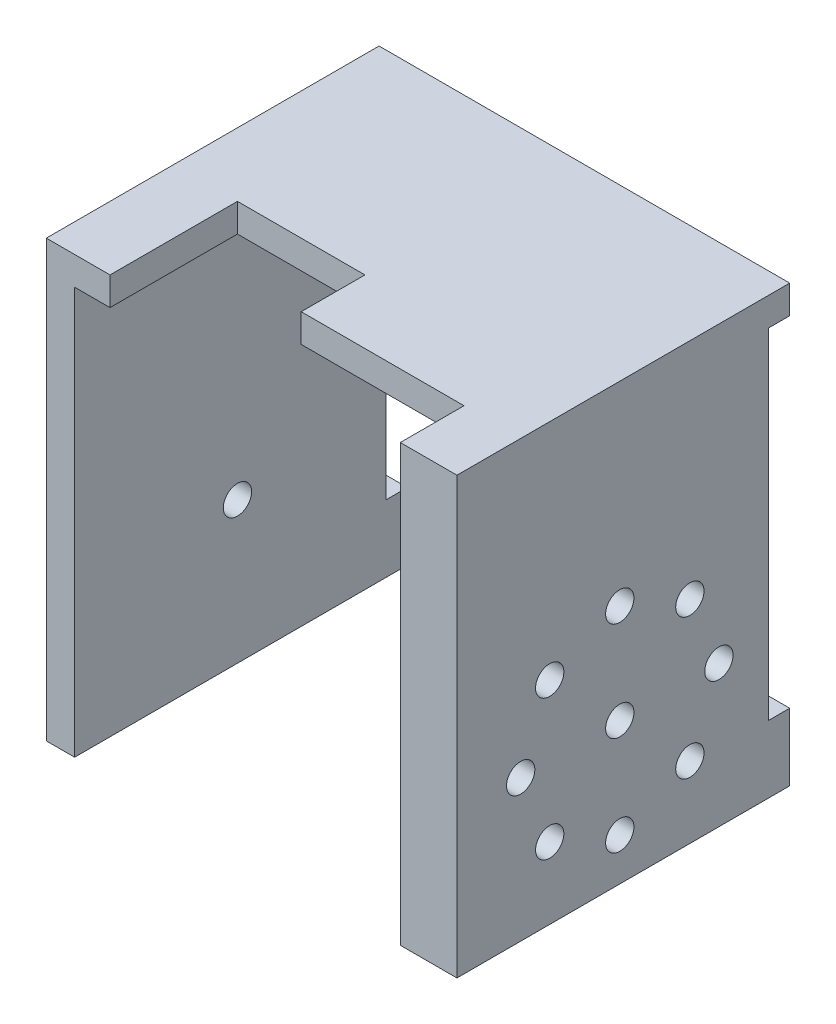
ISO-10303-21;
HEADER;
FILE_DESCRIPTION(('STEP AP214'),'2;1');
FILE_NAME('part.step','',(''),(''),'','','');
FILE_SCHEMA(('AUTOMOTIVE_DESIGN { 1 0 10303 214 1 1 1 1 }'));
ENDSEC;
DATA;
#1=APPLICATION_CONTEXT('core data for automotive mechanical design processes');
#2=APPLICATION_PROTOCOL_DEFINITION('international standard','automotive_design',2000,#1);
#3=PRODUCT_CONTEXT('',#1,'mechanical');
#4=PRODUCT('Part','Part','',(#3));
#5=PRODUCT_RELATED_PRODUCT_CATEGORY('part','',(#4));
#6=PRODUCT_DEFINITION_FORMATION('','',#4);
#7=PRODUCT_DEFINITION_CONTEXT('part definition',#1,'design');
#8=PRODUCT_DEFINITION('design','',#6,#7);
#9=PRODUCT_DEFINITION_SHAPE('','',#8);
#10=(LENGTH_UNIT() NAMED_UNIT(*) SI_UNIT(.MILLI.,.METRE.));
#11=(NAMED_UNIT(*) PLANE_ANGLE_UNIT() SI_UNIT($,.RADIAN.));
#12=(NAMED_UNIT(*) SI_UNIT($,.STERADIAN.) SOLID_ANGLE_UNIT());
#13=UNCERTAINTY_MEASURE_WITH_UNIT(LENGTH_MEASURE(1.E-05),#10,'distance_accuracy_value','');
#14=(GEOMETRIC_REPRESENTATION_CONTEXT(3) GLOBAL_UNCERTAINTY_ASSIGNED_CONTEXT((#13)) GLOBAL_UNIT_ASSIGNED_CONTEXT((#10,
#11,#12)) REPRESENTATION_CONTEXT('',''));
#15=CARTESIAN_POINT('',(0.,0.,0.));
#16=DIRECTION('',(0.,0.,1.));
#17=DIRECTION('',(1.,0.,0.));
#18=AXIS2_PLACEMENT_3D('',#15,#16,#17);
#19=CARTESIAN_POINT('',(46.,37.5,47.));
#20=DIRECTION('',(0.,0.,-1.));
#21=DIRECTION('',(-1.,0.,0.));
#22=AXIS2_PLACEMENT_3D('',#19,#20,#21);
#23=PLANE('',#22);
#24=DIRECTION('',(-1.,0.,0.));
#25=VECTOR('',#24,1.);
#26=CARTESIAN_POINT('',(-4.,41.5,47.));
#27=LINE('',#26,#25);
#28=CARTESIAN_POINT('',(54.,41.5,47.));
#29=VERTEX_POINT('',#28);
#30=CARTESIAN_POINT('',(46.0000000000002,41.5,47.));
#31=VERTEX_POINT('',#30);
#32=EDGE_CURVE('E312',#29,#31,#27,.T.);
#33=ORIENTED_EDGE('',*,*,#32,.T.);
#34=DIRECTION('',(0.,-1.,0.));
#35=VECTOR('',#34,1.);
#36=CARTESIAN_POINT('',(46.,37.5,47.));
#37=LINE('',#36,#35);
#38=CARTESIAN_POINT('',(46.0000000000002,-20.,47.));
#39=VERTEX_POINT('',#38);
#40=EDGE_CURVE('E305',#31,#39,#37,.T.);
#41=ORIENTED_EDGE('',*,*,#40,.T.);
#42=DIRECTION('',(1.,0.,0.));
#43=VECTOR('',#42,1.);
#44=CARTESIAN_POINT('',(46.0000000000002,-20.,47.));
#45=LINE('',#44,#43);
#46=CARTESIAN_POINT('',(54.0000000000002,-20.,47.));
#47=VERTEX_POINT('',#46);
#48=EDGE_CURVE('E308',#39,#47,#45,.T.);
#49=ORIENTED_EDGE('',*,*,#48,.T.);
#50=DIRECTION('',(0.,1.,0.));
#51=VECTOR('',#50,1.);
#52=CARTESIAN_POINT('',(54.,41.5,47.));
#53=LINE('',#52,#51);
#54=EDGE_CURVE('E310',#47,#29,#53,.T.);
#55=ORIENTED_EDGE('',*,*,#54,.T.);
#56=EDGE_LOOP('',(#33,#41,#49,#55));
#57=FACE_BOUND('',#56,.T.);
#58=ADVANCED_FACE('F31',(#57),#23,.F.);
#59=CARTESIAN_POINT('',(46.,37.5,0.));
#60=DIRECTION('',(0.,0.,-1.));
#61=DIRECTION('',(-1.,0.,0.));
#62=AXIS2_PLACEMENT_3D('',#59,#60,#61);
#63=PLANE('',#62);
#64=DIRECTION('',(1.,0.,0.));
#65=VECTOR('',#64,1.);
#66=CARTESIAN_POINT('',(-4.00000000000005,-10.5000000000002,0.));
#67=LINE('',#66,#65);
#68=CARTESIAN_POINT('',(-4.00000000000005,-10.5000000000002,0.));
#69=VERTEX_POINT('',#68);
#70=CARTESIAN_POINT('',(0.,-10.5000000000002,0.));
#71=VERTEX_POINT('',#70);
#72=EDGE_CURVE('E284',#69,#71,#67,.T.);
#73=ORIENTED_EDGE('',*,*,#72,.T.);
#74=DIRECTION('',(0.,1.,0.));
#75=VECTOR('',#74,1.);
#76=CARTESIAN_POINT('',(0.,-20.,0.));
#77=LINE('',#76,#75);
#78=CARTESIAN_POINT('',(0.,-20.,0.));
#79=VERTEX_POINT('',#78);
#80=EDGE_CURVE('E306',#79,#71,#77,.T.);
#81=ORIENTED_EDGE('',*,*,#80,.F.);
#82=DIRECTION('',(1.,0.,0.));
#83=VECTOR('',#82,1.);
#84=CARTESIAN_POINT('',(0.,-20.,0.));
#85=LINE('',#84,#83);
#86=CARTESIAN_POINT('',(-4.00000000000001,-20.,0.));
#87=VERTEX_POINT('',#86);
#88=EDGE_CURVE('E337',#87,#79,#85,.T.);
#89=ORIENTED_EDGE('',*,*,#88,.F.);
#90=DIRECTION('',(0.,-1.,0.));
#91=VECTOR('',#90,1.);
#92=CARTESIAN_POINT('',(-4.00000000000001,-20.,0.));
#93=LINE('',#92,#91);
#94=EDGE_CURVE('E333',#69,#87,#93,.T.);
#95=ORIENTED_EDGE('',*,*,#94,.F.);
#96=EDGE_LOOP('',(#73,#81,#89,#95));
#97=FACE_BOUND('',#96,.T.);
#98=ADVANCED_FACE('F423',(#97),#63,.T.);
#99=DIRECTION('',(-1.,0.,0.));
#100=VECTOR('',#99,1.);
#101=CARTESIAN_POINT('',(46.0000000000002,-10.5,0.));
#102=LINE('',#101,#100);
#103=CARTESIAN_POINT('',(54.0000000000002,-10.5,0.));
#104=VERTEX_POINT('',#103);
#105=CARTESIAN_POINT('',(46.0000000000001,-10.5,0.));
#106=VERTEX_POINT('',#105);
#107=EDGE_CURVE('E40',#104,#106,#102,.T.);
#108=ORIENTED_EDGE('',*,*,#107,.F.);
#109=DIRECTION('',(0.,1.,0.));
#110=VECTOR('',#109,1.);
#111=CARTESIAN_POINT('',(54.,41.5,0.));
#112=LINE('',#111,#110);
#113=CARTESIAN_POINT('',(54.0000000000002,-20.,0.));
#114=VERTEX_POINT('',#113);
#115=EDGE_CURVE('E328',#114,#104,#112,.T.);
#116=ORIENTED_EDGE('',*,*,#115,.F.);
#117=DIRECTION('',(1.,0.,0.));
#118=VECTOR('',#117,1.);
#119=CARTESIAN_POINT('',(46.0000000000002,-20.,0.));
#120=LINE('',#119,#118);
#121=CARTESIAN_POINT('',(46.0000000000002,-20.,0.));
#122=VERTEX_POINT('',#121);
#123=EDGE_CURVE('E325',#122,#114,#120,.T.);
#124=ORIENTED_EDGE('',*,*,#123,.F.);
#125=DIRECTION('',(0.,-1.,0.));
#126=VECTOR('',#125,1.);
#127=CARTESIAN_POINT('',(46.,37.5,0.));
#128=LINE('',#127,#126);
#129=EDGE_CURVE('E323',#106,#122,#128,.T.);
#130=ORIENTED_EDGE('',*,*,#129,.F.);
#131=EDGE_LOOP('',(#108,#116,#124,#130));
#132=FACE_BOUND('',#131,.T.);
#133=ADVANCED_FACE('F376',(#132),#63,.T.);
#134=CARTESIAN_POINT('',(0.,37.5,47.));
#135=DIRECTION('',(0.,1.,0.));
#136=DIRECTION('',(-1.,0.,0.));
#137=AXIS2_PLACEMENT_3D('',#134,#135,#136);
#138=PLANE('',#137);
#139=DIRECTION('',(0.,0.,-1.));
#140=VECTOR('',#139,1.);
#141=CARTESIAN_POINT('',(46.,37.5,47.));
#142=LINE('',#141,#140);
#143=CARTESIAN_POINT('',(46.,37.5,38.));
#144=VERTEX_POINT('',#143);
#145=CARTESIAN_POINT('',(46.,37.5,3.00000000000001));
#146=VERTEX_POINT('',#145);
#147=EDGE_CURVE('E361',#144,#146,#142,.T.);
#148=ORIENTED_EDGE('',*,*,#147,.F.);
#149=DIRECTION('',(1.,0.,0.));
#150=VECTOR('',#149,1.);
#151=CARTESIAN_POINT('',(23.,37.5,38.));
#152=LINE('',#151,#150);
#153=CARTESIAN_POINT('',(23.,37.5,38.));
#154=VERTEX_POINT('',#153);
#155=EDGE_CURVE('E186',#154,#144,#152,.T.);
#156=ORIENTED_EDGE('',*,*,#155,.F.);
#157=DIRECTION('',(0.,0.,1.));
#158=VECTOR('',#157,1.);
#159=CARTESIAN_POINT('',(23.,37.5,38.));
#160=LINE('',#159,#158);
#161=CARTESIAN_POINT('',(23.,37.5,29.));
#162=VERTEX_POINT('',#161);
#163=EDGE_CURVE('E189',#162,#154,#160,.T.);
#164=ORIENTED_EDGE('',*,*,#163,.F.);
#165=DIRECTION('',(1.,0.,0.));
#166=VECTOR('',#165,1.);
#167=CARTESIAN_POINT('',(5.00000000000004,37.5,29.));
#168=LINE('',#167,#166);
#169=CARTESIAN_POINT('',(5.00000000000004,37.5,29.));
#170=VERTEX_POINT('',#169);
#171=EDGE_CURVE('E199',#170,#162,#168,.T.);
#172=ORIENTED_EDGE('',*,*,#171,.F.);
#173=DIRECTION('',(0.,0.,-1.));
#174=VECTOR('',#173,1.);
#175=CARTESIAN_POINT('',(5.00000000000003,37.5,47.));
#176=LINE('',#175,#174);
#177=CARTESIAN_POINT('',(5.00000000000003,37.5,47.));
#178=VERTEX_POINT('',#177);
#179=EDGE_CURVE('E166',#178,#170,#176,.T.);
#180=ORIENTED_EDGE('',*,*,#179,.F.);
#181=DIRECTION('',(1.,0.,0.));
#182=VECTOR('',#181,1.);
#183=CARTESIAN_POINT('',(0.,37.5,47.));
#184=LINE('',#183,#182);
#185=CARTESIAN_POINT('',(0.,37.5,47.));
#186=VERTEX_POINT('',#185);
#187=EDGE_CURVE('E302',#186,#178,#184,.T.);
#188=ORIENTED_EDGE('',*,*,#187,.F.);
#189=DIRECTION('',(0.,0.,-1.));
#190=VECTOR('',#189,1.);
#191=CARTESIAN_POINT('',(0.,37.5,47.));
#192=LINE('',#191,#190);
#193=CARTESIAN_POINT('',(0.,37.4999999999998,3.00000000000001));
#194=VERTEX_POINT('',#193);
#195=EDGE_CURVE('E321',#186,#194,#192,.T.);
#196=ORIENTED_EDGE('',*,*,#195,.T.);
#197=DIRECTION('',(1.,0.,0.));
#198=VECTOR('',#197,1.);
#199=CARTESIAN_POINT('',(-4.00000000000021,37.4999999999998,3.00000000000001));
#200=LINE('',#199,#198);
#201=CARTESIAN_POINT('',(-4.00000000000021,37.4999999999998,3.00000000000001));
#202=VERTEX_POINT('',#201);
#203=EDGE_CURVE('E292',#202,#194,#200,.T.);
#204=ORIENTED_EDGE('',*,*,#203,.F.);
#205=DIRECTION('',(0.,0.,1.));
#206=VECTOR('',#205,1.);
#207=CARTESIAN_POINT('',(-4.00000000000021,37.4999999999998,0.));
#208=LINE('',#207,#206);
#209=CARTESIAN_POINT('',(-4.,37.4999999999998,0.));
#210=VERTEX_POINT('',#209);
#211=EDGE_CURVE('E267',#210,#202,#208,.T.);
#212=ORIENTED_EDGE('',*,*,#211,.F.);
#213=DIRECTION('',(1.,0.,0.));
#214=VECTOR('',#213,1.);
#215=CARTESIAN_POINT('',(0.,37.5,0.));
#216=LINE('',#215,#214);
#217=CARTESIAN_POINT('',(54.,37.5,0.));
#218=VERTEX_POINT('',#217);
#219=EDGE_CURVE('E55',#210,#218,#216,.T.);
#220=ORIENTED_EDGE('',*,*,#219,.T.);
#221=DIRECTION('',(0.,0.,1.));
#222=VECTOR('',#221,1.);
#223=CARTESIAN_POINT('',(54.,37.5,0.));
#224=LINE('',#223,#222);
#225=CARTESIAN_POINT('',(54.,37.5,3.00000000000001));
#226=VERTEX_POINT('',#225);
#227=EDGE_CURVE('E266',#218,#226,#224,.T.);
#228=ORIENTED_EDGE('',*,*,#227,.T.);
#229=EDGE_CURVE('E277',#146,#226,#200,.T.);
#230=ORIENTED_EDGE('',*,*,#229,.F.);
#231=EDGE_LOOP('',(#148,#156,#164,#172,#180,#188,#196,#204,#212,#220,#228,#230));
#232=FACE_BOUND('',#231,.T.);
#233=ADVANCED_FACE('F33',(#232),#138,.F.);
#234=CARTESIAN_POINT('',(46.,37.5,47.));
#235=DIRECTION('',(1.,0.,0.));
#236=DIRECTION('',(0.,1.,0.));
#237=AXIS2_PLACEMENT_3D('',#234,#235,#236);
#238=PLANE('',#237);
#239=CARTESIAN_POINT('',(46.0000000000001,9.89949493661152,33.899494936612));
#240=DIRECTION('',(1.,0.,0.));
#241=DIRECTION('',(0.,1.,0.));
#242=AXIS2_PLACEMENT_3D('',#239,#240,#241);
#243=CIRCLE('',#242,2.00000000000028);
#244=CARTESIAN_POINT('',(46.0000000000001,11.8994949366118,33.899494936612));
#245=VERTEX_POINT('',#244);
#246=EDGE_CURVE('E210',#245,#245,#243,.F.);
#247=ORIENTED_EDGE('',*,*,#246,.F.);
#248=EDGE_LOOP('',(#247));
#249=FACE_BOUND('',#248,.T.);
#250=CARTESIAN_POINT('',(46.0000000000001,-1.07975958797385E-13,37.9999999999998));
#251=DIRECTION('',(1.,0.,0.));
#252=DIRECTION('',(0.,1.,0.));
#253=AXIS2_PLACEMENT_3D('',#250,#251,#252);
#254=CIRCLE('',#253,2.);
#255=CARTESIAN_POINT('',(46.0000000000001,1.99999999999989,37.9999999999998));
#256=VERTEX_POINT('',#255);
#257=EDGE_CURVE('E216',#256,#256,#254,.F.);
#258=ORIENTED_EDGE('',*,*,#257,.F.);
#259=EDGE_LOOP('',(#258));
#260=FACE_BOUND('',#259,.T.);
#261=CARTESIAN_POINT('',(46.0000000000002,-9.89949493661177,33.8994949366114));
#262=DIRECTION('',(1.,0.,0.));
#263=DIRECTION('',(0.,1.,0.));
#264=AXIS2_PLACEMENT_3D('',#261,#262,#263);
#265=CIRCLE('',#264,2.);
#266=CARTESIAN_POINT('',(46.0000000000002,-7.89949493661177,33.8994949366114));
#267=VERTEX_POINT('',#266);
#268=EDGE_CURVE('E222',#267,#267,#265,.F.);
#269=ORIENTED_EDGE('',*,*,#268,.F.);
#270=EDGE_LOOP('',(#269));
#271=FACE_BOUND('',#270,.T.);
#272=CARTESIAN_POINT('',(46.0000000000002,-14.0000000000001,23.9999999999997));
#273=DIRECTION('',(1.,0.,0.));
#274=DIRECTION('',(0.,1.,0.));
#275=AXIS2_PLACEMENT_3D('',#272,#273,#274);
#276=CIRCLE('',#275,2.);
#277=CARTESIAN_POINT('',(46.0000000000002,-12.0000000000001,23.9999999999997));
#278=VERTEX_POINT('',#277);
#279=EDGE_CURVE('E228',#278,#278,#276,.F.);
#280=ORIENTED_EDGE('',*,*,#279,.F.);
#281=EDGE_LOOP('',(#280));
#282=FACE_BOUND('',#281,.T.);
#283=CARTESIAN_POINT('',(46.0000000000002,-9.89949493661163,14.1005050633881));
#284=DIRECTION('',(1.,0.,0.));
#285=DIRECTION('',(0.,1.,0.));
#286=AXIS2_PLACEMENT_3D('',#283,#284,#285);
#287=CIRCLE('',#286,2.);
#288=CARTESIAN_POINT('',(46.0000000000002,-7.89949493661163,14.1005050633881));
#289=VERTEX_POINT('',#288);
#290=EDGE_CURVE('E234',#289,#289,#287,.F.);
#291=ORIENTED_EDGE('',*,*,#290,.F.);
#292=EDGE_LOOP('',(#291));
#293=FACE_BOUND('',#292,.T.);
#294=CARTESIAN_POINT('',(46.0000000000001,0.,9.9999999999998));
#295=DIRECTION('',(1.,0.,0.));
#296=DIRECTION('',(0.,1.,0.));
#297=AXIS2_PLACEMENT_3D('',#294,#295,#296);
#298=CIRCLE('',#297,2.);
#299=CARTESIAN_POINT('',(46.0000000000001,2.0000000000001,9.9999999999998));
#300=VERTEX_POINT('',#299);
#301=EDGE_CURVE('E240',#300,#300,#298,.F.);
#302=ORIENTED_EDGE('',*,*,#301,.F.);
#303=EDGE_LOOP('',(#302));
#304=FACE_BOUND('',#303,.T.);
#305=CARTESIAN_POINT('',(46.0000000000001,9.89949493661173,14.1005050633883));
#306=DIRECTION('',(1.,0.,0.));
#307=DIRECTION('',(0.,1.,0.));
#308=AXIS2_PLACEMENT_3D('',#305,#306,#307);
#309=CIRCLE('',#308,2.);
#310=CARTESIAN_POINT('',(46.0000000000001,11.8994949366117,14.1005050633883));
#311=VERTEX_POINT('',#310);
#312=EDGE_CURVE('E246',#311,#311,#309,.F.);
#313=ORIENTED_EDGE('',*,*,#312,.F.);
#314=EDGE_LOOP('',(#313));
#315=FACE_BOUND('',#314,.T.);
#316=CARTESIAN_POINT('',(46.0000000000001,13.9999999999999,24.));
#317=DIRECTION('',(1.,0.,0.));
#318=DIRECTION('',(0.,1.,0.));
#319=AXIS2_PLACEMENT_3D('',#316,#317,#318);
#320=CIRCLE('',#319,2.);
#321=CARTESIAN_POINT('',(46.0000000000001,15.9999999999999,24.));
#322=VERTEX_POINT('',#321);
#323=EDGE_CURVE('E252',#322,#322,#320,.F.);
#324=ORIENTED_EDGE('',*,*,#323,.F.);
#325=EDGE_LOOP('',(#324));
#326=FACE_BOUND('',#325,.T.);
#327=CARTESIAN_POINT('',(46.0000000000001,0.,24.));
#328=DIRECTION('',(1.,0.,0.));
#329=DIRECTION('',(0.,1.,0.));
#330=AXIS2_PLACEMENT_3D('',#327,#328,#329);
#331=CIRCLE('',#330,2.);
#332=CARTESIAN_POINT('',(46.0000000000001,1.99999999999994,24.));
#333=VERTEX_POINT('',#332);
#334=EDGE_CURVE('E263',#333,#333,#331,.T.);
#335=ORIENTED_EDGE('',*,*,#334,.T.);
#336=EDGE_LOOP('',(#335));
#337=FACE_BOUND('',#336,.T.);
#338=DIRECTION('',(0.,-1.,0.));
#339=VECTOR('',#338,1.);
#340=CARTESIAN_POINT('',(46.,37.5,3.));
#341=LINE('',#340,#339);
#342=CARTESIAN_POINT('',(46.0000000000001,-10.5,3.));
#343=VERTEX_POINT('',#342);
#344=EDGE_CURVE('E299',#146,#343,#341,.T.);
#345=ORIENTED_EDGE('',*,*,#344,.T.);
#346=DIRECTION('',(0.,0.,-1.));
#347=VECTOR('',#346,1.);
#348=CARTESIAN_POINT('',(46.0000000000002,-10.5,47.));
#349=LINE('',#348,#347);
#350=EDGE_CURVE('E296',#343,#106,#349,.T.);
#351=ORIENTED_EDGE('',*,*,#350,.T.);
#352=ORIENTED_EDGE('',*,*,#129,.T.);
#353=DIRECTION('',(0.,0.,-1.));
#354=VECTOR('',#353,1.);
#355=CARTESIAN_POINT('',(46.0000000000002,-20.,47.));
#356=LINE('',#355,#354);
#357=EDGE_CURVE('E358',#39,#122,#356,.T.);
#358=ORIENTED_EDGE('',*,*,#357,.F.);
#359=ORIENTED_EDGE('',*,*,#40,.F.);
#360=DIRECTION('',(0.,0.,1.));
#361=VECTOR('',#360,1.);
#362=CARTESIAN_POINT('',(46.,41.5,38.));
#363=LINE('',#362,#361);
#364=CARTESIAN_POINT('',(46.,41.5,38.));
#365=VERTEX_POINT('',#364);
#366=EDGE_CURVE('E195',#365,#31,#363,.T.);
#367=ORIENTED_EDGE('',*,*,#366,.F.);
#368=DIRECTION('',(0.,-1.,0.));
#369=VECTOR('',#368,1.);
#370=CARTESIAN_POINT('',(46.,41.5,38.));
#371=LINE('',#370,#369);
#372=EDGE_CURVE('E203',#365,#144,#371,.T.);
#373=ORIENTED_EDGE('',*,*,#372,.T.);
#374=ORIENTED_EDGE('',*,*,#147,.T.);
#375=EDGE_LOOP('',(#345,#351,#352,#358,#359,#367,#373,#374));
#376=FACE_BOUND('',#375,.T.);
#377=ADVANCED_FACE('F372',(#249,#260,#271,#282,#293,#304,#315,#326,#337,#376),#238,.F.);
#378=CARTESIAN_POINT('',(46.0000000000002,-20.,47.));
#379=DIRECTION('',(0.,1.,0.));
#380=DIRECTION('',(-1.,0.,0.));
#381=AXIS2_PLACEMENT_3D('',#378,#379,#380);
#382=PLANE('',#381);
#383=ORIENTED_EDGE('',*,*,#123,.T.);
#384=DIRECTION('',(0.,0.,-1.));
#385=VECTOR('',#384,1.);
#386=CARTESIAN_POINT('',(54.0000000000002,-20.,47.));
#387=LINE('',#386,#385);
#388=EDGE_CURVE('E355',#47,#114,#387,.T.);
#389=ORIENTED_EDGE('',*,*,#388,.F.);
#390=ORIENTED_EDGE('',*,*,#48,.F.);
#391=ORIENTED_EDGE('',*,*,#357,.T.);
#392=EDGE_LOOP('',(#383,#389,#390,#391));
#393=FACE_BOUND('',#392,.T.);
#394=ADVANCED_FACE('F379',(#393),#382,.F.);
#395=CARTESIAN_POINT('',(54.,41.5,47.));
#396=DIRECTION('',(-1.,0.,0.));
#397=DIRECTION('',(0.,-1.,0.));
#398=AXIS2_PLACEMENT_3D('',#395,#396,#397);
#399=PLANE('',#398);
#400=CARTESIAN_POINT('',(54.0000000000001,9.89949493661154,33.899494936612));
#401=DIRECTION('',(1.,0.,0.));
#402=DIRECTION('',(0.,1.,0.));
#403=AXIS2_PLACEMENT_3D('',#400,#401,#402);
#404=CIRCLE('',#403,2.00000000000028);
#405=CARTESIAN_POINT('',(54.0000000000001,11.8994949366118,33.899494936612));
#406=VERTEX_POINT('',#405);
#407=EDGE_CURVE('E205',#406,#406,#404,.T.);
#408=ORIENTED_EDGE('',*,*,#407,.F.);
#409=EDGE_LOOP('',(#408));
#410=FACE_BOUND('',#409,.T.);
#411=CARTESIAN_POINT('',(54.0000000000001,0.,37.9999999999998));
#412=DIRECTION('',(1.,0.,0.));
#413=DIRECTION('',(0.,1.,0.));
#414=AXIS2_PLACEMENT_3D('',#411,#412,#413);
#415=CIRCLE('',#414,2.);
#416=CARTESIAN_POINT('',(54.0000000000001,1.99999999999992,37.9999999999998));
#417=VERTEX_POINT('',#416);
#418=EDGE_CURVE('E213',#417,#417,#415,.T.);
#419=ORIENTED_EDGE('',*,*,#418,.F.);
#420=EDGE_LOOP('',(#419));
#421=FACE_BOUND('',#420,.T.);
#422=CARTESIAN_POINT('',(54.0000000000002,-9.89949493661175,33.8994949366114));
#423=DIRECTION('',(1.,0.,0.));
#424=DIRECTION('',(0.,1.,0.));
#425=AXIS2_PLACEMENT_3D('',#422,#423,#424);
#426=CIRCLE('',#425,2.);
#427=CARTESIAN_POINT('',(54.0000000000002,-7.89949493661174,33.8994949366114));
#428=VERTEX_POINT('',#427);
#429=EDGE_CURVE('E219',#428,#428,#426,.T.);
#430=ORIENTED_EDGE('',*,*,#429,.F.);
#431=EDGE_LOOP('',(#430));
#432=FACE_BOUND('',#431,.T.);
#433=CARTESIAN_POINT('',(54.0000000000002,-14.,23.9999999999997));
#434=DIRECTION('',(1.,0.,0.));
#435=DIRECTION('',(0.,1.,0.));
#436=AXIS2_PLACEMENT_3D('',#433,#434,#435);
#437=CIRCLE('',#436,2.);
#438=CARTESIAN_POINT('',(54.0000000000002,-12.,23.9999999999997));
#439=VERTEX_POINT('',#438);
#440=EDGE_CURVE('E225',#439,#439,#437,.T.);
#441=ORIENTED_EDGE('',*,*,#440,.F.);
#442=EDGE_LOOP('',(#441));
#443=FACE_BOUND('',#442,.T.);
#444=CARTESIAN_POINT('',(54.0000000000002,-9.89949493661161,14.1005050633881));
#445=DIRECTION('',(1.,0.,0.));
#446=DIRECTION('',(0.,1.,0.));
#447=AXIS2_PLACEMENT_3D('',#444,#445,#446);
#448=CIRCLE('',#447,2.);
#449=CARTESIAN_POINT('',(54.0000000000002,-7.8994949366116,14.1005050633881));
#450=VERTEX_POINT('',#449);
#451=EDGE_CURVE('E231',#450,#450,#448,.T.);
#452=ORIENTED_EDGE('',*,*,#451,.F.);
#453=EDGE_LOOP('',(#452));
#454=FACE_BOUND('',#453,.T.);
#455=CARTESIAN_POINT('',(54.0000000000001,1.20330574772636E-13,9.9999999999998));
#456=DIRECTION('',(1.,0.,0.));
#457=DIRECTION('',(0.,1.,0.));
#458=AXIS2_PLACEMENT_3D('',#455,#456,#457);
#459=CIRCLE('',#458,2.);
#460=CARTESIAN_POINT('',(54.0000000000001,2.00000000000012,9.9999999999998));
#461=VERTEX_POINT('',#460);
#462=EDGE_CURVE('E237',#461,#461,#459,.T.);
#463=ORIENTED_EDGE('',*,*,#462,.F.);
#464=EDGE_LOOP('',(#463));
#465=FACE_BOUND('',#464,.T.);
#466=CARTESIAN_POINT('',(54.0000000000001,9.89949493661176,14.1005050633883));
#467=DIRECTION('',(1.,0.,0.));
#468=DIRECTION('',(0.,1.,0.));
#469=AXIS2_PLACEMENT_3D('',#466,#467,#468);
#470=CIRCLE('',#469,2.);
#471=CARTESIAN_POINT('',(54.0000000000001,11.8994949366118,14.1005050633883));
#472=VERTEX_POINT('',#471);
#473=EDGE_CURVE('E243',#472,#472,#470,.T.);
#474=ORIENTED_EDGE('',*,*,#473,.F.);
#475=EDGE_LOOP('',(#474));
#476=FACE_BOUND('',#475,.T.);
#477=CARTESIAN_POINT('',(54.0000000000001,14.,24.));
#478=DIRECTION('',(1.,0.,0.));
#479=DIRECTION('',(0.,1.,0.));
#480=AXIS2_PLACEMENT_3D('',#477,#478,#479);
#481=CIRCLE('',#480,2.);
#482=CARTESIAN_POINT('',(54.0000000000001,16.,24.));
#483=VERTEX_POINT('',#482);
#484=EDGE_CURVE('E249',#483,#483,#481,.T.);
#485=ORIENTED_EDGE('',*,*,#484,.F.);
#486=EDGE_LOOP('',(#485));
#487=FACE_BOUND('',#486,.T.);
#488=CARTESIAN_POINT('',(54.0000000000001,0.,24.));
#489=DIRECTION('',(1.,0.,0.));
#490=DIRECTION('',(0.,1.,0.));
#491=AXIS2_PLACEMENT_3D('',#488,#489,#490);
#492=CIRCLE('',#491,2.);
#493=CARTESIAN_POINT('',(54.0000000000001,1.99999999999997,24.));
#494=VERTEX_POINT('',#493);
#495=EDGE_CURVE('E255',#494,#494,#492,.T.);
#496=ORIENTED_EDGE('',*,*,#495,.F.);
#497=EDGE_LOOP('',(#496));
#498=FACE_BOUND('',#497,.T.);
#499=ORIENTED_EDGE('',*,*,#115,.T.);
#500=DIRECTION('',(0.,0.,-1.));
#501=VECTOR('',#500,1.);
#502=CARTESIAN_POINT('',(54.0000000000002,-10.5,3.));
#503=LINE('',#502,#501);
#504=CARTESIAN_POINT('',(54.0000000000002,-10.5,3.));
#505=VERTEX_POINT('',#504);
#506=EDGE_CURVE('E271',#505,#104,#503,.T.);
#507=ORIENTED_EDGE('',*,*,#506,.F.);
#508=DIRECTION('',(0.,-1.,0.));
#509=VECTOR('',#508,1.);
#510=CARTESIAN_POINT('',(54.,37.5,3.00000000000001));
#511=LINE('',#510,#509);
#512=EDGE_CURVE('E280',#226,#505,#511,.T.);
#513=ORIENTED_EDGE('',*,*,#512,.F.);
#514=ORIENTED_EDGE('',*,*,#227,.F.);
#515=CARTESIAN_POINT('',(54.,41.5,0.));
#516=VERTEX_POINT('',#515);
#517=EDGE_CURVE('E327',#218,#516,#112,.T.);
#518=ORIENTED_EDGE('',*,*,#517,.T.);
#519=DIRECTION('',(0.,0.,-1.));
#520=VECTOR('',#519,1.);
#521=CARTESIAN_POINT('',(54.,41.5,47.));
#522=LINE('',#521,#520);
#523=EDGE_CURVE('E352',#29,#516,#522,.T.);
#524=ORIENTED_EDGE('',*,*,#523,.F.);
#525=ORIENTED_EDGE('',*,*,#54,.F.);
#526=ORIENTED_EDGE('',*,*,#388,.T.);
#527=EDGE_LOOP('',(#499,#507,#513,#514,#518,#524,#525,#526));
#528=FACE_BOUND('',#527,.T.);
#529=ADVANCED_FACE('F383',(#410,#421,#432,#443,#454,#465,#476,#487,#498,#528),#399,.F.);
#530=CARTESIAN_POINT('',(-4.,41.5,47.));
#531=DIRECTION('',(0.,-1.,0.));
#532=DIRECTION('',(0.,0.,-1.));
#533=AXIS2_PLACEMENT_3D('',#530,#531,#532);
#534=PLANE('',#533);
#535=DIRECTION('',(1.,0.,0.));
#536=VECTOR('',#535,1.);
#537=CARTESIAN_POINT('',(23.,41.5,38.));
#538=LINE('',#537,#536);
#539=CARTESIAN_POINT('',(23.,41.5,38.));
#540=VERTEX_POINT('',#539);
#541=EDGE_CURVE('E193',#540,#365,#538,.T.);
#542=ORIENTED_EDGE('',*,*,#541,.T.);
#543=ORIENTED_EDGE('',*,*,#366,.T.);
#544=ORIENTED_EDGE('',*,*,#32,.F.);
#545=ORIENTED_EDGE('',*,*,#523,.T.);
#546=DIRECTION('',(-1.,0.,0.));
#547=VECTOR('',#546,1.);
#548=CARTESIAN_POINT('',(-4.,41.5,0.));
#549=LINE('',#548,#547);
#550=CARTESIAN_POINT('',(-4.,41.5,0.));
#551=VERTEX_POINT('',#550);
#552=EDGE_CURVE('E331',#516,#551,#549,.T.);
#553=ORIENTED_EDGE('',*,*,#552,.T.);
#554=DIRECTION('',(0.,0.,-1.));
#555=VECTOR('',#554,1.);
#556=CARTESIAN_POINT('',(-4.,41.5,47.));
#557=LINE('',#556,#555);
#558=CARTESIAN_POINT('',(-4.,41.5,47.));
#559=VERTEX_POINT('',#558);
#560=EDGE_CURVE('E349',#559,#551,#557,.T.);
#561=ORIENTED_EDGE('',*,*,#560,.F.);
#562=CARTESIAN_POINT('',(5.00000000000004,41.5,47.));
#563=VERTEX_POINT('',#562);
#564=EDGE_CURVE('E185',#563,#559,#27,.T.);
#565=ORIENTED_EDGE('',*,*,#564,.F.);
#566=DIRECTION('',(0.,0.,-1.));
#567=VECTOR('',#566,1.);
#568=CARTESIAN_POINT('',(5.00000000000004,41.5,47.));
#569=LINE('',#568,#567);
#570=CARTESIAN_POINT('',(5.00000000000004,41.5,29.));
#571=VERTEX_POINT('',#570);
#572=EDGE_CURVE('E47',#563,#571,#569,.T.);
#573=ORIENTED_EDGE('',*,*,#572,.T.);
#574=DIRECTION('',(1.,0.,0.));
#575=VECTOR('',#574,1.);
#576=CARTESIAN_POINT('',(5.00000000000004,41.5,29.));
#577=LINE('',#576,#575);
#578=CARTESIAN_POINT('',(23.,41.5,29.));
#579=VERTEX_POINT('',#578);
#580=EDGE_CURVE('E174',#571,#579,#577,.T.);
#581=ORIENTED_EDGE('',*,*,#580,.T.);
#582=DIRECTION('',(0.,0.,1.));
#583=VECTOR('',#582,1.);
#584=CARTESIAN_POINT('',(23.,41.5,38.));
#585=LINE('',#584,#583);
#586=EDGE_CURVE('E179',#579,#540,#585,.T.);
#587=ORIENTED_EDGE('',*,*,#586,.T.);
#588=EDGE_LOOP('',(#542,#543,#544,#545,#553,#561,#565,#573,#581,#587));
#589=FACE_BOUND('',#588,.T.);
#590=ADVANCED_FACE('F183',(#589),#534,.F.);
#591=CARTESIAN_POINT('',(-4.00000000000001,-20.,47.));
#592=DIRECTION('',(1.,0.,0.));
#593=DIRECTION('',(0.,1.,0.));
#594=AXIS2_PLACEMENT_3D('',#591,#592,#593);
#595=PLANE('',#594);
#596=CARTESIAN_POINT('',(-4.00000000000008,-2.27653745641779E-13,24.));
#597=DIRECTION('',(1.,0.,0.));
#598=DIRECTION('',(0.,1.,0.));
#599=AXIS2_PLACEMENT_3D('',#596,#597,#598);
#600=CIRCLE('',#599,2.);
#601=CARTESIAN_POINT('',(-4.00000000000009,1.99999999999978,24.));
#602=VERTEX_POINT('',#601);
#603=EDGE_CURVE('E258',#602,#602,#600,.T.);
#604=ORIENTED_EDGE('',*,*,#603,.T.);
#605=EDGE_LOOP('',(#604));
#606=FACE_BOUND('',#605,.T.);
#607=DIRECTION('',(0.,-1.,0.));
#608=VECTOR('',#607,1.);
#609=CARTESIAN_POINT('',(-4.00000000000021,37.4999999999998,3.00000000000001));
#610=LINE('',#609,#608);
#611=CARTESIAN_POINT('',(-4.00000000000005,-10.5000000000002,3.));
#612=VERTEX_POINT('',#611);
#613=EDGE_CURVE('E270',#202,#612,#610,.T.);
#614=ORIENTED_EDGE('',*,*,#613,.T.);
#615=DIRECTION('',(0.,0.,-1.));
#616=VECTOR('',#615,1.);
#617=CARTESIAN_POINT('',(-4.00000000000005,-10.5000000000002,3.));
#618=LINE('',#617,#616);
#619=EDGE_CURVE('E274',#612,#69,#618,.T.);
#620=ORIENTED_EDGE('',*,*,#619,.T.);
#621=ORIENTED_EDGE('',*,*,#94,.T.);
#622=DIRECTION('',(0.,0.,-1.));
#623=VECTOR('',#622,1.);
#624=CARTESIAN_POINT('',(-4.00000000000001,-20.,47.));
#625=LINE('',#624,#623);
#626=CARTESIAN_POINT('',(-4.00000000000001,-20.,47.));
#627=VERTEX_POINT('',#626);
#628=EDGE_CURVE('E346',#627,#87,#625,.T.);
#629=ORIENTED_EDGE('',*,*,#628,.F.);
#630=DIRECTION('',(0.,-1.,0.));
#631=VECTOR('',#630,1.);
#632=CARTESIAN_POINT('',(-4.00000000000001,-20.,47.));
#633=LINE('',#632,#631);
#634=EDGE_CURVE('E315',#559,#627,#633,.T.);
#635=ORIENTED_EDGE('',*,*,#634,.F.);
#636=ORIENTED_EDGE('',*,*,#560,.T.);
#637=EDGE_CURVE('E334',#551,#210,#93,.T.);
#638=ORIENTED_EDGE('',*,*,#637,.T.);
#639=ORIENTED_EDGE('',*,*,#211,.T.);
#640=EDGE_LOOP('',(#614,#620,#621,#629,#635,#636,#638,#639));
#641=FACE_BOUND('',#640,.T.);
#642=ADVANCED_FACE('F403',(#606,#641),#595,.F.);
#643=CARTESIAN_POINT('',(0.,-20.,47.));
#644=DIRECTION('',(0.,1.,0.));
#645=DIRECTION('',(-1.,0.,0.));
#646=AXIS2_PLACEMENT_3D('',#643,#644,#645);
#647=PLANE('',#646);
#648=ORIENTED_EDGE('',*,*,#88,.T.);
#649=DIRECTION('',(0.,0.,-1.));
#650=VECTOR('',#649,1.);
#651=CARTESIAN_POINT('',(0.,-20.,47.));
#652=LINE('',#651,#650);
#653=CARTESIAN_POINT('',(0.,-20.,47.));
#654=VERTEX_POINT('',#653);
#655=EDGE_CURVE('E343',#654,#79,#652,.T.);
#656=ORIENTED_EDGE('',*,*,#655,.F.);
#657=DIRECTION('',(1.,0.,0.));
#658=VECTOR('',#657,1.);
#659=CARTESIAN_POINT('',(0.,-20.,47.));
#660=LINE('',#659,#658);
#661=EDGE_CURVE('E317',#627,#654,#660,.T.);
#662=ORIENTED_EDGE('',*,*,#661,.F.);
#663=ORIENTED_EDGE('',*,*,#628,.T.);
#664=EDGE_LOOP('',(#648,#656,#662,#663));
#665=FACE_BOUND('',#664,.T.);
#666=ADVANCED_FACE('F437',(#665),#647,.F.);
#667=CARTESIAN_POINT('',(0.,-20.,47.));
#668=DIRECTION('',(-1.,0.,0.));
#669=DIRECTION('',(0.,0.,1.));
#670=AXIS2_PLACEMENT_3D('',#667,#668,#669);
#671=PLANE('',#670);
#672=CARTESIAN_POINT('',(0.,-2.14114440463423E-13,24.));
#673=DIRECTION('',(-1.,0.,0.));
#674=DIRECTION('',(0.,0.,1.));
#675=AXIS2_PLACEMENT_3D('',#672,#673,#674);
#676=CIRCLE('',#675,2.);
#677=CARTESIAN_POINT('',(0.,-2.14114440463423E-13,26.));
#678=VERTEX_POINT('',#677);
#679=EDGE_CURVE('E35',#678,#678,#676,.T.);
#680=ORIENTED_EDGE('',*,*,#679,.T.);
#681=EDGE_LOOP('',(#680));
#682=FACE_BOUND('',#681,.T.);
#683=ORIENTED_EDGE('',*,*,#80,.T.);
#684=DIRECTION('',(0.,0.,1.));
#685=VECTOR('',#684,1.);
#686=CARTESIAN_POINT('',(0.,-10.5000000000002,47.));
#687=LINE('',#686,#685);
#688=CARTESIAN_POINT('',(0.,-10.5000000000002,3.));
#689=VERTEX_POINT('',#688);
#690=EDGE_CURVE('E287',#71,#689,#687,.T.);
#691=ORIENTED_EDGE('',*,*,#690,.T.);
#692=DIRECTION('',(0.,1.,0.));
#693=VECTOR('',#692,1.);
#694=CARTESIAN_POINT('',(0.,-20.,3.));
#695=LINE('',#694,#693);
#696=EDGE_CURVE('E11',#689,#194,#695,.T.);
#697=ORIENTED_EDGE('',*,*,#696,.T.);
#698=ORIENTED_EDGE('',*,*,#195,.F.);
#699=DIRECTION('',(0.,1.,0.));
#700=VECTOR('',#699,1.);
#701=CARTESIAN_POINT('',(0.,-20.,47.));
#702=LINE('',#701,#700);
#703=EDGE_CURVE('E319',#654,#186,#702,.T.);
#704=ORIENTED_EDGE('',*,*,#703,.F.);
#705=ORIENTED_EDGE('',*,*,#655,.T.);
#706=EDGE_LOOP('',(#683,#691,#697,#698,#704,#705));
#707=FACE_BOUND('',#706,.T.);
#708=ADVANCED_FACE('F432',(#682,#707),#671,.F.);
#709=ORIENTED_EDGE('',*,*,#187,.T.);
#710=DIRECTION('',(0.,-1.,0.));
#711=VECTOR('',#710,1.);
#712=CARTESIAN_POINT('',(5.00000000000004,41.5,47.));
#713=LINE('',#712,#711);
#714=EDGE_CURVE('E171',#563,#178,#713,.T.);
#715=ORIENTED_EDGE('',*,*,#714,.F.);
#716=ORIENTED_EDGE('',*,*,#564,.T.);
#717=ORIENTED_EDGE('',*,*,#634,.T.);
#718=ORIENTED_EDGE('',*,*,#661,.T.);
#719=ORIENTED_EDGE('',*,*,#703,.T.);
#720=EDGE_LOOP('',(#709,#715,#716,#717,#718,#719));
#721=FACE_BOUND('',#720,.T.);
#722=ADVANCED_FACE('F407',(#721),#23,.F.);
#723=ORIENTED_EDGE('',*,*,#219,.F.);
#724=ORIENTED_EDGE('',*,*,#637,.F.);
#725=ORIENTED_EDGE('',*,*,#552,.F.);
#726=ORIENTED_EDGE('',*,*,#517,.F.);
#727=EDGE_LOOP('',(#723,#724,#725,#726));
#728=FACE_BOUND('',#727,.T.);
#729=ADVANCED_FACE('F400',(#728),#63,.T.);
#730=CARTESIAN_POINT('',(-4.00000000000005,-10.5000000000002,3.));
#731=DIRECTION('',(0.,-1.,0.));
#732=DIRECTION('',(1.,0.,0.));
#733=AXIS2_PLACEMENT_3D('',#730,#731,#732);
#734=PLANE('',#733);
#735=DIRECTION('',(1.,0.,0.));
#736=VECTOR('',#735,1.);
#737=CARTESIAN_POINT('',(-4.00000000000005,-10.5000000000002,3.));
#738=LINE('',#737,#736);
#739=EDGE_CURVE('E291',#343,#505,#738,.T.);
#740=ORIENTED_EDGE('',*,*,#739,.T.);
#741=ORIENTED_EDGE('',*,*,#506,.T.);
#742=ORIENTED_EDGE('',*,*,#107,.T.);
#743=ORIENTED_EDGE('',*,*,#350,.F.);
#744=EDGE_LOOP('',(#740,#741,#742,#743));
#745=FACE_BOUND('',#744,.T.);
#746=ADVANCED_FACE('F365',(#745),#734,.F.);
#747=CARTESIAN_POINT('',(-4.00000000000021,37.4999999999998,3.00000000000001));
#748=DIRECTION('',(0.,0.,1.));
#749=DIRECTION('',(0.,-1.,0.));
#750=AXIS2_PLACEMENT_3D('',#747,#748,#749);
#751=PLANE('',#750);
#752=ORIENTED_EDGE('',*,*,#229,.T.);
#753=ORIENTED_EDGE('',*,*,#512,.T.);
#754=ORIENTED_EDGE('',*,*,#739,.F.);
#755=ORIENTED_EDGE('',*,*,#344,.F.);
#756=EDGE_LOOP('',(#752,#753,#754,#755));
#757=FACE_BOUND('',#756,.T.);
#758=ADVANCED_FACE('F396',(#757),#751,.F.);
#759=EDGE_CURVE('E288',#612,#689,#738,.T.);
#760=ORIENTED_EDGE('',*,*,#759,.F.);
#761=ORIENTED_EDGE('',*,*,#613,.F.);
#762=ORIENTED_EDGE('',*,*,#203,.T.);
#763=ORIENTED_EDGE('',*,*,#696,.F.);
#764=EDGE_LOOP('',(#760,#761,#762,#763));
#765=FACE_BOUND('',#764,.T.);
#766=ADVANCED_FACE('F499',(#765),#751,.F.);
#767=ORIENTED_EDGE('',*,*,#72,.F.);
#768=ORIENTED_EDGE('',*,*,#619,.F.);
#769=ORIENTED_EDGE('',*,*,#759,.T.);
#770=ORIENTED_EDGE('',*,*,#690,.F.);
#771=EDGE_LOOP('',(#767,#768,#769,#770));
#772=FACE_BOUND('',#771,.T.);
#773=ADVANCED_FACE('F493',(#772),#734,.F.);
#774=CARTESIAN_POINT('',(-4.00000000000008,-2.27653745641779E-13,24.));
#775=DIRECTION('',(1.,0.,0.));
#776=DIRECTION('',(0.,1.,0.));
#777=AXIS2_PLACEMENT_3D('',#774,#775,#776);
#778=CYLINDRICAL_SURFACE('',#777,2.);
#779=ORIENTED_EDGE('',*,*,#603,.F.);
#780=EDGE_LOOP('',(#779));
#781=FACE_BOUND('',#780,.T.);
#782=ORIENTED_EDGE('',*,*,#679,.F.);
#783=EDGE_LOOP('',(#782));
#784=FACE_BOUND('',#783,.T.);
#785=ADVANCED_FACE('F483',(#781,#784),#778,.F.);
#786=ORIENTED_EDGE('',*,*,#495,.T.);
#787=EDGE_LOOP('',(#786));
#788=FACE_BOUND('',#787,.T.);
#789=ORIENTED_EDGE('',*,*,#334,.F.);
#790=EDGE_LOOP('',(#789));
#791=FACE_BOUND('',#790,.T.);
#792=ADVANCED_FACE('F480',(#788,#791),#778,.F.);
#793=CARTESIAN_POINT('',(-4.00100000000032,13.9999999999998,24.));
#794=DIRECTION('',(1.,0.,0.));
#795=DIRECTION('',(0.,1.,0.));
#796=AXIS2_PLACEMENT_3D('',#793,#794,#795);
#797=CYLINDRICAL_SURFACE('',#796,2.);
#798=ORIENTED_EDGE('',*,*,#484,.T.);
#799=EDGE_LOOP('',(#798));
#800=FACE_BOUND('',#799,.T.);
#801=ORIENTED_EDGE('',*,*,#323,.T.);
#802=EDGE_LOOP('',(#801));
#803=FACE_BOUND('',#802,.T.);
#804=ADVANCED_FACE('F482',(#800,#803),#797,.F.);
#805=CARTESIAN_POINT('',(-4.00100000000031,9.89949493661156,14.1005050633883));
#806=DIRECTION('',(1.,0.,0.));
#807=DIRECTION('',(0.,1.,0.));
#808=AXIS2_PLACEMENT_3D('',#805,#806,#807);
#809=CYLINDRICAL_SURFACE('',#808,2.);
#810=ORIENTED_EDGE('',*,*,#473,.T.);
#811=EDGE_LOOP('',(#810));
#812=FACE_BOUND('',#811,.T.);
#813=ORIENTED_EDGE('',*,*,#312,.T.);
#814=EDGE_LOOP('',(#813));
#815=FACE_BOUND('',#814,.T.);
#816=ADVANCED_FACE('F490',(#812,#815),#809,.F.);
#817=CARTESIAN_POINT('',(-4.00100000000027,0.,9.9999999999998));
#818=DIRECTION('',(1.,0.,0.));
#819=DIRECTION('',(0.,1.,0.));
#820=AXIS2_PLACEMENT_3D('',#817,#818,#819);
#821=CYLINDRICAL_SURFACE('',#820,2.);
#822=ORIENTED_EDGE('',*,*,#462,.T.);
#823=EDGE_LOOP('',(#822));
#824=FACE_BOUND('',#823,.T.);
#825=ORIENTED_EDGE('',*,*,#301,.T.);
#826=EDGE_LOOP('',(#825));
#827=FACE_BOUND('',#826,.T.);
#828=ADVANCED_FACE('F548',(#824,#827),#821,.F.);
#829=CARTESIAN_POINT('',(-4.00100000000024,-9.8994949366118,14.1005050633881));
#830=DIRECTION('',(1.,0.,0.));
#831=DIRECTION('',(0.,1.,0.));
#832=AXIS2_PLACEMENT_3D('',#829,#830,#831);
#833=CYLINDRICAL_SURFACE('',#832,2.);
#834=ORIENTED_EDGE('',*,*,#451,.T.);
#835=EDGE_LOOP('',(#834));
#836=FACE_BOUND('',#835,.T.);
#837=ORIENTED_EDGE('',*,*,#290,.T.);
#838=EDGE_LOOP('',(#837));
#839=FACE_BOUND('',#838,.T.);
#840=ADVANCED_FACE('F557',(#836,#839),#833,.F.);
#841=CARTESIAN_POINT('',(-4.00100000000023,-14.0000000000002,23.9999999999997));
#842=DIRECTION('',(1.,0.,0.));
#843=DIRECTION('',(0.,1.,0.));
#844=AXIS2_PLACEMENT_3D('',#841,#842,#843);
#845=CYLINDRICAL_SURFACE('',#844,2.);
#846=ORIENTED_EDGE('',*,*,#440,.T.);
#847=EDGE_LOOP('',(#846));
#848=FACE_BOUND('',#847,.T.);
#849=ORIENTED_EDGE('',*,*,#279,.T.);
#850=EDGE_LOOP('',(#849));
#851=FACE_BOUND('',#850,.T.);
#852=ADVANCED_FACE('F567',(#848,#851),#845,.F.);
#853=CARTESIAN_POINT('',(-4.00100000000024,-9.89949493661194,33.8994949366114));
#854=DIRECTION('',(1.,0.,0.));
#855=DIRECTION('',(0.,1.,0.));
#856=AXIS2_PLACEMENT_3D('',#853,#854,#855);
#857=CYLINDRICAL_SURFACE('',#856,2.);
#858=ORIENTED_EDGE('',*,*,#429,.T.);
#859=EDGE_LOOP('',(#858));
#860=FACE_BOUND('',#859,.T.);
#861=ORIENTED_EDGE('',*,*,#268,.T.);
#862=EDGE_LOOP('',(#861));
#863=FACE_BOUND('',#862,.T.);
#864=ADVANCED_FACE('F577',(#860,#863),#857,.F.);
#865=CARTESIAN_POINT('',(-4.00100000000027,-2.77220658353126E-13,37.9999999999998));
#866=DIRECTION('',(1.,0.,0.));
#867=DIRECTION('',(0.,1.,0.));
#868=AXIS2_PLACEMENT_3D('',#865,#866,#867);
#869=CYLINDRICAL_SURFACE('',#868,2.);
#870=ORIENTED_EDGE('',*,*,#418,.T.);
#871=EDGE_LOOP('',(#870));
#872=FACE_BOUND('',#871,.T.);
#873=ORIENTED_EDGE('',*,*,#257,.T.);
#874=EDGE_LOOP('',(#873));
#875=FACE_BOUND('',#874,.T.);
#876=ADVANCED_FACE('F587',(#872,#875),#869,.F.);
#877=CARTESIAN_POINT('',(-4.00100000000031,9.89949493661135,33.899494936612));
#878=DIRECTION('',(1.,0.,0.));
#879=DIRECTION('',(0.,1.,0.));
#880=AXIS2_PLACEMENT_3D('',#877,#878,#879);
#881=CYLINDRICAL_SURFACE('',#880,2.00000000000028);
#882=ORIENTED_EDGE('',*,*,#407,.T.);
#883=EDGE_LOOP('',(#882));
#884=FACE_BOUND('',#883,.T.);
#885=ORIENTED_EDGE('',*,*,#246,.T.);
#886=EDGE_LOOP('',(#885));
#887=FACE_BOUND('',#886,.T.);
#888=ADVANCED_FACE('F420',(#884,#887),#881,.F.);
#889=CARTESIAN_POINT('',(23.,41.5,38.));
#890=DIRECTION('',(0.,0.,-1.));
#891=DIRECTION('',(-1.,0.,0.));
#892=AXIS2_PLACEMENT_3D('',#889,#890,#891);
#893=PLANE('',#892);
#894=ORIENTED_EDGE('',*,*,#155,.T.);
#895=ORIENTED_EDGE('',*,*,#372,.F.);
#896=ORIENTED_EDGE('',*,*,#541,.F.);
#897=DIRECTION('',(0.,-1.,0.));
#898=VECTOR('',#897,1.);
#899=CARTESIAN_POINT('',(23.,41.5,38.));
#900=LINE('',#899,#898);
#901=EDGE_CURVE('E206',#540,#154,#900,.T.);
#902=ORIENTED_EDGE('',*,*,#901,.T.);
#903=EDGE_LOOP('',(#894,#895,#896,#902));
#904=FACE_BOUND('',#903,.T.);
#905=ADVANCED_FACE('F390',(#904),#893,.F.);
#906=CARTESIAN_POINT('',(23.,41.5,38.));
#907=DIRECTION('',(1.,0.,0.));
#908=DIRECTION('',(0.,1.,0.));
#909=AXIS2_PLACEMENT_3D('',#906,#907,#908);
#910=PLANE('',#909);
#911=ORIENTED_EDGE('',*,*,#163,.T.);
#912=ORIENTED_EDGE('',*,*,#901,.F.);
#913=ORIENTED_EDGE('',*,*,#586,.F.);
#914=DIRECTION('',(0.,-1.,0.));
#915=VECTOR('',#914,1.);
#916=CARTESIAN_POINT('',(23.,41.5,29.));
#917=LINE('',#916,#915);
#918=EDGE_CURVE('E170',#579,#162,#917,.T.);
#919=ORIENTED_EDGE('',*,*,#918,.T.);
#920=EDGE_LOOP('',(#911,#912,#913,#919));
#921=FACE_BOUND('',#920,.T.);
#922=ADVANCED_FACE('F412',(#921),#910,.F.);
#923=CARTESIAN_POINT('',(5.00000000000004,41.5,29.));
#924=DIRECTION('',(0.,0.,-1.));
#925=DIRECTION('',(-1.,0.,0.));
#926=AXIS2_PLACEMENT_3D('',#923,#924,#925);
#927=PLANE('',#926);
#928=ORIENTED_EDGE('',*,*,#171,.T.);
#929=ORIENTED_EDGE('',*,*,#918,.F.);
#930=ORIENTED_EDGE('',*,*,#580,.F.);
#931=DIRECTION('',(0.,-1.,0.));
#932=VECTOR('',#931,1.);
#933=CARTESIAN_POINT('',(5.00000000000004,41.5,29.));
#934=LINE('',#933,#932);
#935=EDGE_CURVE('E162',#571,#170,#934,.T.);
#936=ORIENTED_EDGE('',*,*,#935,.T.);
#937=EDGE_LOOP('',(#928,#929,#930,#936));
#938=FACE_BOUND('',#937,.T.);
#939=ADVANCED_FACE('F175',(#938),#927,.F.);
#940=CARTESIAN_POINT('',(5.00000000000004,41.5,47.));
#941=DIRECTION('',(-1.,0.,0.));
#942=DIRECTION('',(0.,-1.,0.));
#943=AXIS2_PLACEMENT_3D('',#940,#941,#942);
#944=PLANE('',#943);
#945=ORIENTED_EDGE('',*,*,#179,.T.);
#946=ORIENTED_EDGE('',*,*,#935,.F.);
#947=ORIENTED_EDGE('',*,*,#572,.F.);
#948=ORIENTED_EDGE('',*,*,#714,.T.);
#949=EDGE_LOOP('',(#945,#946,#947,#948));
#950=FACE_BOUND('',#949,.T.);
#951=ADVANCED_FACE('F164',(#950),#944,.F.);
#952=CLOSED_SHELL('',(#58,#98,#133,#233,#377,#394,#529,#590,#642,#666,#708,#722,#729,#746,#758,
#766,#773,#785,#792,#804,#816,#828,#840,#852,#864,#876,#888,#905,#922,#939,#951));
#953=MANIFOLD_SOLID_BREP('B2',#952);
#954=ADVANCED_BREP_SHAPE_REPRESENTATION('',(#18,#953),#14);
#955=SHAPE_DEFINITION_REPRESENTATION(#9,#954);
ENDSEC;
END-ISO-10303-21;
